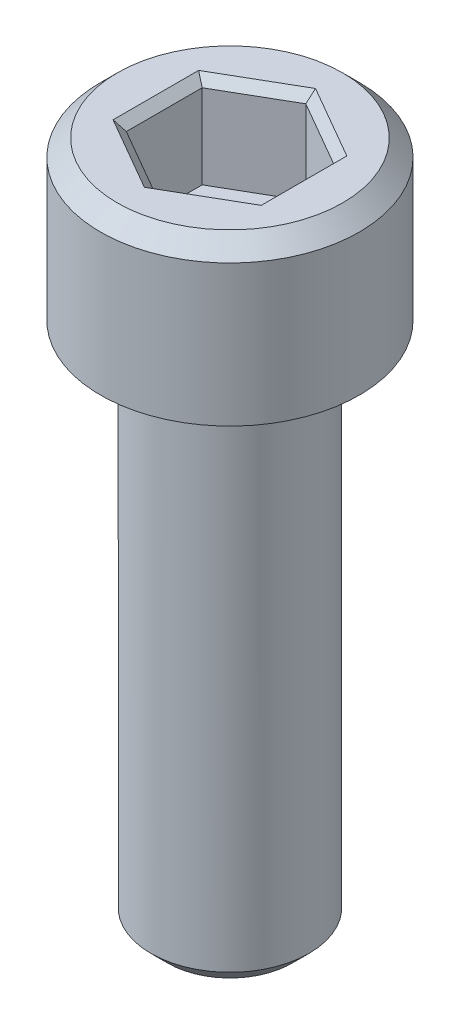
ISO-10303-21;
HEADER;
FILE_DESCRIPTION(('STEP AP214'),'2;1');
FILE_NAME('part.step','',(''),(''),'','','');
FILE_SCHEMA(('AUTOMOTIVE_DESIGN { 1 0 10303 214 1 1 1 1 }'));
ENDSEC;
DATA;
#1=APPLICATION_CONTEXT('core data for automotive mechanical design processes');
#2=APPLICATION_PROTOCOL_DEFINITION('international standard','automotive_design',2000,#1);
#3=PRODUCT_CONTEXT('',#1,'mechanical');
#4=PRODUCT('Part','Part','',(#3));
#5=PRODUCT_RELATED_PRODUCT_CATEGORY('part','',(#4));
#6=PRODUCT_DEFINITION_FORMATION('','',#4);
#7=PRODUCT_DEFINITION_CONTEXT('part definition',#1,'design');
#8=PRODUCT_DEFINITION('design','',#6,#7);
#9=PRODUCT_DEFINITION_SHAPE('','',#8);
#10=(LENGTH_UNIT() NAMED_UNIT(*) SI_UNIT(.MILLI.,.METRE.));
#11=(NAMED_UNIT(*) PLANE_ANGLE_UNIT() SI_UNIT($,.RADIAN.));
#12=(NAMED_UNIT(*) SI_UNIT($,.STERADIAN.) SOLID_ANGLE_UNIT());
#13=UNCERTAINTY_MEASURE_WITH_UNIT(LENGTH_MEASURE(1.E-05),#10,'distance_accuracy_value','');
#14=(GEOMETRIC_REPRESENTATION_CONTEXT(3) GLOBAL_UNCERTAINTY_ASSIGNED_CONTEXT((#13)) GLOBAL_UNIT_ASSIGNED_CONTEXT((#10,
#11,#12)) REPRESENTATION_CONTEXT('',''));
#15=CARTESIAN_POINT('',(0.,0.,0.));
#16=DIRECTION('',(0.,0.,1.));
#17=DIRECTION('',(1.,0.,0.));
#18=AXIS2_PLACEMENT_3D('',#15,#16,#17);
#19=CARTESIAN_POINT('',(-3.96874999999999,-2.794,0.));
#20=DIRECTION('',(0.,-1.,0.));
#21=DIRECTION('',(0.,0.,-1.));
#22=AXIS2_PLACEMENT_3D('',#19,#20,#21);
#23=PLANE('',#22);
#24=DIRECTION('',(-0.866025403784439,0.,0.5));
#25=VECTOR('',#24,1.);
#26=CARTESIAN_POINT('',(1.98437500000001,-2.794,1.14567944042317));
#27=LINE('',#26,#25);
#28=CARTESIAN_POINT('',(1.98437500000001,-2.794,1.14567944042317));
#29=VERTEX_POINT('',#28);
#30=CARTESIAN_POINT('',(0.,-2.794,2.29135888084634));
#31=VERTEX_POINT('',#30);
#32=EDGE_CURVE('E86',#29,#31,#27,.T.);
#33=ORIENTED_EDGE('',*,*,#32,.F.);
#34=DIRECTION('',(0.,0.,1.));
#35=VECTOR('',#34,1.);
#36=CARTESIAN_POINT('',(1.98437500000001,-2.794,-1.14567944042316));
#37=LINE('',#36,#35);
#38=CARTESIAN_POINT('',(1.98437500000001,-2.794,-1.14567944042316));
#39=VERTEX_POINT('',#38);
#40=EDGE_CURVE('E91',#39,#29,#37,.T.);
#41=ORIENTED_EDGE('',*,*,#40,.F.);
#42=DIRECTION('',(0.866025403784439,0.,0.5));
#43=VECTOR('',#42,1.);
#44=CARTESIAN_POINT('',(0.,-2.794,-2.29135888084632));
#45=LINE('',#44,#43);
#46=CARTESIAN_POINT('',(0.,-2.794,-2.29135888084632));
#47=VERTEX_POINT('',#46);
#48=EDGE_CURVE('E176',#47,#39,#45,.T.);
#49=ORIENTED_EDGE('',*,*,#48,.F.);
#50=DIRECTION('',(0.866025403784438,0.,-0.5));
#51=VECTOR('',#50,1.);
#52=CARTESIAN_POINT('',(-1.98437499999999,-2.794,-1.14567944042316));
#53=LINE('',#52,#51);
#54=CARTESIAN_POINT('',(-1.984375,-2.794,-1.14567944042316));
#55=VERTEX_POINT('',#54);
#56=EDGE_CURVE('E182',#55,#47,#53,.T.);
#57=ORIENTED_EDGE('',*,*,#56,.F.);
#58=DIRECTION('',(0.,0.,-1.));
#59=VECTOR('',#58,1.);
#60=CARTESIAN_POINT('',(-1.984375,-2.794,1.14567944042317));
#61=LINE('',#60,#59);
#62=CARTESIAN_POINT('',(-1.984375,-2.794,1.14567944042317));
#63=VERTEX_POINT('',#62);
#64=EDGE_CURVE('E187',#63,#55,#61,.T.);
#65=ORIENTED_EDGE('',*,*,#64,.F.);
#66=DIRECTION('',(-0.866025403784438,0.,-0.5));
#67=VECTOR('',#66,1.);
#68=CARTESIAN_POINT('',(0.,-2.794,2.29135888084634));
#69=LINE('',#68,#67);
#70=EDGE_CURVE('E102',#31,#63,#69,.T.);
#71=ORIENTED_EDGE('',*,*,#70,.F.);
#72=EDGE_LOOP('',(#33,#41,#49,#57,#65,#71));
#73=FACE_BOUND('',#72,.T.);
#74=ADVANCED_FACE('F17',(#73),#23,.F.);
#75=CARTESIAN_POINT('',(1.98437500000001,-2.794,-1.14567944042316));
#76=DIRECTION('',(-1.,0.,0.));
#77=DIRECTION('',(0.,0.,1.));
#78=AXIS2_PLACEMENT_3D('',#75,#76,#77);
#79=PLANE('',#78);
#80=DIRECTION('',(0.,1.,0.));
#81=VECTOR('',#80,1.);
#82=CARTESIAN_POINT('',(1.98437500000001,-2.794,-1.14567944042316));
#83=LINE('',#82,#81);
#84=CARTESIAN_POINT('',(1.98437500000001,-0.254,-1.14567944042316));
#85=VERTEX_POINT('',#84);
#86=EDGE_CURVE('E96',#39,#85,#83,.T.);
#87=ORIENTED_EDGE('',*,*,#86,.F.);
#88=ORIENTED_EDGE('',*,*,#40,.T.);
#89=DIRECTION('',(0.,1.,0.));
#90=VECTOR('',#89,1.);
#91=CARTESIAN_POINT('',(1.98437500000001,-2.794,1.14567944042317));
#92=LINE('',#91,#90);
#93=CARTESIAN_POINT('',(1.98437500000001,-0.254,1.14567944042317));
#94=VERTEX_POINT('',#93);
#95=EDGE_CURVE('E93',#94,#29,#92,.F.);
#96=ORIENTED_EDGE('',*,*,#95,.F.);
#97=DIRECTION('',(0.,0.,1.));
#98=VECTOR('',#97,1.);
#99=CARTESIAN_POINT('',(1.98437500000001,-0.254,0.));
#100=LINE('',#99,#98);
#101=EDGE_CURVE('E174',#94,#85,#100,.F.);
#102=ORIENTED_EDGE('',*,*,#101,.T.);
#103=EDGE_LOOP('',(#87,#88,#96,#102));
#104=FACE_BOUND('',#103,.T.);
#105=ADVANCED_FACE('F92',(#104),#79,.T.);
#106=CARTESIAN_POINT('',(1.98437500000001,-2.794,1.14567944042317));
#107=DIRECTION('',(-0.5,0.,-0.866025403784439));
#108=DIRECTION('',(-0.866025403784439,0.,0.5));
#109=AXIS2_PLACEMENT_3D('',#106,#107,#108);
#110=PLANE('',#109);
#111=ORIENTED_EDGE('',*,*,#95,.T.);
#112=ORIENTED_EDGE('',*,*,#32,.T.);
#113=DIRECTION('',(0.,1.,0.));
#114=VECTOR('',#113,1.);
#115=CARTESIAN_POINT('',(0.,-2.794,2.29135888084634));
#116=LINE('',#115,#114);
#117=CARTESIAN_POINT('',(0.,-0.253999999999999,2.29135888084634));
#118=VERTEX_POINT('',#117);
#119=EDGE_CURVE('E104',#118,#31,#116,.F.);
#120=ORIENTED_EDGE('',*,*,#119,.F.);
#121=DIRECTION('',(0.866025403784439,0.,-0.5));
#122=VECTOR('',#121,1.);
#123=CARTESIAN_POINT('',(0.,-0.253999999999998,2.29135888084634));
#124=LINE('',#123,#122);
#125=EDGE_CURVE('E108',#118,#94,#124,.T.);
#126=ORIENTED_EDGE('',*,*,#125,.T.);
#127=EDGE_LOOP('',(#111,#112,#120,#126));
#128=FACE_BOUND('',#127,.T.);
#129=ADVANCED_FACE('F106',(#128),#110,.T.);
#130=CARTESIAN_POINT('',(0.,-2.794,2.29135888084634));
#131=DIRECTION('',(0.5,0.,-0.866025403784438));
#132=DIRECTION('',(-0.866025403784438,0.,-0.5));
#133=AXIS2_PLACEMENT_3D('',#130,#131,#132);
#134=PLANE('',#133);
#135=ORIENTED_EDGE('',*,*,#119,.T.);
#136=ORIENTED_EDGE('',*,*,#70,.T.);
#137=DIRECTION('',(0.,1.,0.));
#138=VECTOR('',#137,1.);
#139=CARTESIAN_POINT('',(-1.984375,-2.794,1.14567944042317));
#140=LINE('',#139,#138);
#141=CARTESIAN_POINT('',(-1.984375,-0.254,1.14567944042317));
#142=VERTEX_POINT('',#141);
#143=EDGE_CURVE('E189',#142,#63,#140,.F.);
#144=ORIENTED_EDGE('',*,*,#143,.F.);
#145=DIRECTION('',(0.866025403784438,0.,0.500000000000001));
#146=VECTOR('',#145,1.);
#147=CARTESIAN_POINT('',(-1.984375,-0.254,1.14567944042317));
#148=LINE('',#147,#146);
#149=EDGE_CURVE('E168',#142,#118,#148,.T.);
#150=ORIENTED_EDGE('',*,*,#149,.T.);
#151=EDGE_LOOP('',(#135,#136,#144,#150));
#152=FACE_BOUND('',#151,.T.);
#153=ADVANCED_FACE('F193',(#152),#134,.T.);
#154=CARTESIAN_POINT('',(-1.984375,-2.794,1.14567944042317));
#155=DIRECTION('',(1.,0.,0.));
#156=DIRECTION('',(0.,0.,-1.));
#157=AXIS2_PLACEMENT_3D('',#154,#155,#156);
#158=PLANE('',#157);
#159=ORIENTED_EDGE('',*,*,#143,.T.);
#160=ORIENTED_EDGE('',*,*,#64,.T.);
#161=DIRECTION('',(0.,1.,0.));
#162=VECTOR('',#161,1.);
#163=CARTESIAN_POINT('',(-1.984375,-2.794,-1.14567944042316));
#164=LINE('',#163,#162);
#165=CARTESIAN_POINT('',(-1.984375,-0.253999999999999,-1.14567944042316));
#166=VERTEX_POINT('',#165);
#167=EDGE_CURVE('E184',#166,#55,#164,.F.);
#168=ORIENTED_EDGE('',*,*,#167,.F.);
#169=DIRECTION('',(0.,0.,1.));
#170=VECTOR('',#169,1.);
#171=CARTESIAN_POINT('',(-1.984375,-0.254,0.));
#172=LINE('',#171,#170);
#173=EDGE_CURVE('E163',#166,#142,#172,.T.);
#174=ORIENTED_EDGE('',*,*,#173,.T.);
#175=EDGE_LOOP('',(#159,#160,#168,#174));
#176=FACE_BOUND('',#175,.T.);
#177=ADVANCED_FACE('F223',(#176),#158,.T.);
#178=CARTESIAN_POINT('',(-1.98437499999999,-2.794,-1.14567944042316));
#179=DIRECTION('',(0.5,0.,0.866025403784438));
#180=DIRECTION('',(0.866025403784438,0.,-0.5));
#181=AXIS2_PLACEMENT_3D('',#178,#179,#180);
#182=PLANE('',#181);
#183=ORIENTED_EDGE('',*,*,#167,.T.);
#184=ORIENTED_EDGE('',*,*,#56,.T.);
#185=DIRECTION('',(0.,1.,0.));
#186=VECTOR('',#185,1.);
#187=CARTESIAN_POINT('',(0.,-2.794,-2.29135888084632));
#188=LINE('',#187,#186);
#189=CARTESIAN_POINT('',(0.,-0.254,-2.29135888084632));
#190=VERTEX_POINT('',#189);
#191=EDGE_CURVE('E178',#190,#47,#188,.F.);
#192=ORIENTED_EDGE('',*,*,#191,.F.);
#193=DIRECTION('',(-0.866025403784439,0.,0.499999999999999));
#194=VECTOR('',#193,1.);
#195=CARTESIAN_POINT('',(0.,-0.253999999999999,-2.29135888084632));
#196=LINE('',#195,#194);
#197=EDGE_CURVE('E158',#190,#166,#196,.T.);
#198=ORIENTED_EDGE('',*,*,#197,.T.);
#199=EDGE_LOOP('',(#183,#184,#192,#198));
#200=FACE_BOUND('',#199,.T.);
#201=ADVANCED_FACE('F219',(#200),#182,.T.);
#202=CARTESIAN_POINT('',(0.,-2.794,-2.29135888084632));
#203=DIRECTION('',(-0.5,0.,0.866025403784439));
#204=DIRECTION('',(0.866025403784439,0.,0.5));
#205=AXIS2_PLACEMENT_3D('',#202,#203,#204);
#206=PLANE('',#205);
#207=ORIENTED_EDGE('',*,*,#191,.T.);
#208=ORIENTED_EDGE('',*,*,#48,.T.);
#209=ORIENTED_EDGE('',*,*,#86,.T.);
#210=DIRECTION('',(-0.866025403784439,0.,-0.499999999999999));
#211=VECTOR('',#210,1.);
#212=CARTESIAN_POINT('',(1.98437500000001,-0.253999999999997,-1.14567944042316));
#213=LINE('',#212,#211);
#214=EDGE_CURVE('E150',#85,#190,#213,.T.);
#215=ORIENTED_EDGE('',*,*,#214,.T.);
#216=EDGE_LOOP('',(#207,#208,#209,#215));
#217=FACE_BOUND('',#216,.T.);
#218=ADVANCED_FACE('F214',(#217),#206,.T.);
#219=CARTESIAN_POINT('',(2.23837500000001,0.,0.));
#220=DIRECTION('',(0.707106781186548,-0.707106781186548,0.));
#221=DIRECTION('',(0.707106781186548,0.707106781186548,0.));
#222=AXIS2_PLACEMENT_3D('',#219,#220,#221);
#223=PLANE('',#222);
#224=ORIENTED_EDGE('',*,*,#101,.F.);
#225=DIRECTION('',(0.654653670707971,0.654653670707979,0.377964473009234));
#226=VECTOR('',#225,1.);
#227=CARTESIAN_POINT('',(1.98437500000001,-0.254,1.14567944042317));
#228=LINE('',#227,#226);
#229=CARTESIAN_POINT('',(2.23837500000001,0.,1.29232640879734));
#230=VERTEX_POINT('',#229);
#231=EDGE_CURVE('E171',#94,#230,#228,.T.);
#232=ORIENTED_EDGE('',*,*,#231,.T.);
#233=DIRECTION('',(0.,0.,1.));
#234=VECTOR('',#233,1.);
#235=CARTESIAN_POINT('',(2.23837500000001,0.,0.));
#236=LINE('',#235,#234);
#237=CARTESIAN_POINT('',(2.23837500000001,0.,-1.29232640879732));
#238=VERTEX_POINT('',#237);
#239=EDGE_CURVE('E146',#238,#230,#236,.T.);
#240=ORIENTED_EDGE('',*,*,#239,.F.);
#241=DIRECTION('',(-0.654653670707983,-0.654653670707975,0.377964473009222));
#242=VECTOR('',#241,1.);
#243=CARTESIAN_POINT('',(2.23837500000001,0.,-1.29232640879732));
#244=LINE('',#243,#242);
#245=EDGE_CURVE('E153',#238,#85,#244,.T.);
#246=ORIENTED_EDGE('',*,*,#245,.T.);
#247=EDGE_LOOP('',(#224,#232,#240,#246));
#248=FACE_BOUND('',#247,.T.);
#249=ADVANCED_FACE('F209',(#248),#223,.F.);
#250=CARTESIAN_POINT('',(1.11918750000001,0.,1.938489613196));
#251=DIRECTION('',(0.353553390593273,-0.707106781186548,0.612372435695794));
#252=DIRECTION('',(0.,-0.654653670707977,-0.755928946018455));
#253=AXIS2_PLACEMENT_3D('',#250,#251,#252);
#254=PLANE('',#253);
#255=ORIENTED_EDGE('',*,*,#125,.F.);
#256=DIRECTION('',(0.,-0.654653670707977,-0.755928946018455));
#257=VECTOR('',#256,1.);
#258=CARTESIAN_POINT('',(0.,-0.319767857142859,2.21541670079543));
#259=LINE('',#258,#257);
#260=CARTESIAN_POINT('',(0.,0.,2.58465281759467));
#261=VERTEX_POINT('',#260);
#262=EDGE_CURVE('E166',#118,#261,#259,.F.);
#263=ORIENTED_EDGE('',*,*,#262,.T.);
#264=DIRECTION('',(-0.866025403784439,0.,0.5));
#265=VECTOR('',#264,1.);
#266=CARTESIAN_POINT('',(2.23837500000001,0.,1.29232640879734));
#267=LINE('',#266,#265);
#268=EDGE_CURVE('E143',#230,#261,#267,.T.);
#269=ORIENTED_EDGE('',*,*,#268,.F.);
#270=ORIENTED_EDGE('',*,*,#231,.F.);
#271=EDGE_LOOP('',(#255,#263,#269,#270));
#272=FACE_BOUND('',#271,.T.);
#273=ADVANCED_FACE('F200',(#272),#254,.F.);
#274=CARTESIAN_POINT('',(-1.1191875,0.,1.938489613196));
#275=DIRECTION('',(-0.353553390593274,-0.707106781186548,0.612372435695794));
#276=DIRECTION('',(0.,-0.654653670707977,-0.755928946018455));
#277=AXIS2_PLACEMENT_3D('',#274,#275,#276);
#278=PLANE('',#277);
#279=DIRECTION('',(-0.866025403784437,0.,-0.500000000000002));
#280=VECTOR('',#279,1.);
#281=CARTESIAN_POINT('',(0.,0.,2.58465281759467));
#282=LINE('',#281,#280);
#283=CARTESIAN_POINT('',(-2.238375,0.,1.29232640879733));
#284=VERTEX_POINT('',#283);
#285=EDGE_CURVE('E140',#261,#284,#282,.T.);
#286=ORIENTED_EDGE('',*,*,#285,.F.);
#287=ORIENTED_EDGE('',*,*,#262,.F.);
#288=ORIENTED_EDGE('',*,*,#149,.F.);
#289=DIRECTION('',(-0.65465367070798,0.65465367070798,0.377964473009216));
#290=VECTOR('',#289,1.);
#291=CARTESIAN_POINT('',(-1.984375,-0.254,1.14567944042317));
#292=LINE('',#291,#290);
#293=EDGE_CURVE('E161',#142,#284,#292,.T.);
#294=ORIENTED_EDGE('',*,*,#293,.T.);
#295=EDGE_LOOP('',(#286,#287,#288,#294));
#296=FACE_BOUND('',#295,.T.);
#297=ADVANCED_FACE('F203',(#296),#278,.F.);
#298=CARTESIAN_POINT('',(-2.238375,0.,0.));
#299=DIRECTION('',(-0.707106781186548,-0.707106781186548,0.));
#300=DIRECTION('',(0.707106781186548,-0.707106781186548,0.));
#301=AXIS2_PLACEMENT_3D('',#298,#299,#300);
#302=PLANE('',#301);
#303=DIRECTION('',(0.,0.,1.));
#304=VECTOR('',#303,1.);
#305=CARTESIAN_POINT('',(-2.238375,0.,0.));
#306=LINE('',#305,#304);
#307=CARTESIAN_POINT('',(-2.238375,0.,-1.29232640879732));
#308=VERTEX_POINT('',#307);
#309=EDGE_CURVE('E137',#284,#308,#306,.F.);
#310=ORIENTED_EDGE('',*,*,#309,.F.);
#311=ORIENTED_EDGE('',*,*,#293,.F.);
#312=ORIENTED_EDGE('',*,*,#173,.F.);
#313=DIRECTION('',(-0.654653670707983,0.654653670707975,-0.377964473009222));
#314=VECTOR('',#313,1.);
#315=CARTESIAN_POINT('',(-1.984375,-0.253999999999995,-1.14567944042316));
#316=LINE('',#315,#314);
#317=EDGE_CURVE('E156',#166,#308,#316,.T.);
#318=ORIENTED_EDGE('',*,*,#317,.T.);
#319=EDGE_LOOP('',(#310,#311,#312,#318));
#320=FACE_BOUND('',#319,.T.);
#321=ADVANCED_FACE('F221',(#320),#302,.F.);
#322=CARTESIAN_POINT('',(-1.1191875,0.,-1.93848961319598));
#323=DIRECTION('',(-0.353553390593274,-0.707106781186548,-0.612372435695794));
#324=DIRECTION('',(0.,0.654653670707977,-0.755928946018455));
#325=AXIS2_PLACEMENT_3D('',#322,#323,#324);
#326=PLANE('',#325);
#327=ORIENTED_EDGE('',*,*,#197,.F.);
#328=DIRECTION('',(0.,0.654653670707977,-0.755928946018455));
#329=VECTOR('',#328,1.);
#330=CARTESIAN_POINT('',(0.,-0.319767857142856,-2.21541670079542));
#331=LINE('',#330,#329);
#332=CARTESIAN_POINT('',(0.,0.,-2.58465281759465));
#333=VERTEX_POINT('',#332);
#334=EDGE_CURVE('E35',#190,#333,#331,.T.);
#335=ORIENTED_EDGE('',*,*,#334,.T.);
#336=DIRECTION('',(0.866025403784439,0.,-0.499999999999999));
#337=VECTOR('',#336,1.);
#338=CARTESIAN_POINT('',(-2.238375,0.,-1.29232640879732));
#339=LINE('',#338,#337);
#340=EDGE_CURVE('E134',#308,#333,#339,.T.);
#341=ORIENTED_EDGE('',*,*,#340,.F.);
#342=ORIENTED_EDGE('',*,*,#317,.F.);
#343=EDGE_LOOP('',(#327,#335,#341,#342));
#344=FACE_BOUND('',#343,.T.);
#345=ADVANCED_FACE('F216',(#344),#326,.F.);
#346=CARTESIAN_POINT('',(1.1191875,0.,-1.93848961319599));
#347=DIRECTION('',(0.353553390593274,-0.707106781186548,-0.612372435695794));
#348=DIRECTION('',(0.,0.654653670707977,-0.755928946018455));
#349=AXIS2_PLACEMENT_3D('',#346,#347,#348);
#350=PLANE('',#349);
#351=ORIENTED_EDGE('',*,*,#214,.F.);
#352=ORIENTED_EDGE('',*,*,#245,.F.);
#353=DIRECTION('',(0.866025403784439,0.,0.5));
#354=VECTOR('',#353,1.);
#355=CARTESIAN_POINT('',(0.,0.,-2.58465281759465));
#356=LINE('',#355,#354);
#357=EDGE_CURVE('E125',#333,#238,#356,.T.);
#358=ORIENTED_EDGE('',*,*,#357,.F.);
#359=ORIENTED_EDGE('',*,*,#334,.F.);
#360=EDGE_LOOP('',(#351,#352,#358,#359));
#361=FACE_BOUND('',#360,.T.);
#362=ADVANCED_FACE('F212',(#361),#350,.F.);
#363=CARTESIAN_POINT('',(0.,0.,0.));
#364=DIRECTION('',(0.,1.,0.));
#365=DIRECTION('',(0.,0.,1.));
#366=AXIS2_PLACEMENT_3D('',#363,#364,#365);
#367=PLANE('',#366);
#368=CARTESIAN_POINT('',(0.,0.,0.));
#369=DIRECTION('',(0.,-1.,0.));
#370=DIRECTION('',(0.,0.,-1.));
#371=AXIS2_PLACEMENT_3D('',#368,#369,#370);
#372=CIRCLE('',#371,3.40360000006967);
#373=CARTESIAN_POINT('',(0.,0.,-3.40360000006967));
#374=VERTEX_POINT('',#373);
#375=EDGE_CURVE('E20',#374,#374,#372,.T.);
#376=ORIENTED_EDGE('',*,*,#375,.F.);
#377=EDGE_LOOP('',(#376));
#378=FACE_BOUND('',#377,.T.);
#379=ORIENTED_EDGE('',*,*,#340,.T.);
#380=ORIENTED_EDGE('',*,*,#357,.T.);
#381=ORIENTED_EDGE('',*,*,#239,.T.);
#382=ORIENTED_EDGE('',*,*,#268,.T.);
#383=ORIENTED_EDGE('',*,*,#285,.T.);
#384=ORIENTED_EDGE('',*,*,#309,.T.);
#385=EDGE_LOOP('',(#379,#380,#381,#382,#383,#384));
#386=FACE_BOUND('',#385,.T.);
#387=ADVANCED_FACE('F206',(#378,#386),#367,.T.);
#388=CARTESIAN_POINT('',(0.,-0.507999999967979,0.));
#389=DIRECTION('',(0.,-1.,0.));
#390=DIRECTION('',(0.,0.,-1.));
#391=AXIS2_PLACEMENT_3D('',#388,#389,#390);
#392=CONICAL_SURFACE('',#391,3.91160000003765,0.785398163397448);
#393=ORIENTED_EDGE('',*,*,#375,.T.);
#394=EDGE_LOOP('',(#393));
#395=FACE_BOUND('',#394,.T.);
#396=CARTESIAN_POINT('',(0.,-0.508,0.));
#397=DIRECTION('',(0.,-1.,0.));
#398=DIRECTION('',(0.,0.,-1.));
#399=AXIS2_PLACEMENT_3D('',#396,#397,#398);
#400=CIRCLE('',#399,3.9116);
#401=CARTESIAN_POINT('',(0.,-0.508,-3.9116));
#402=VERTEX_POINT('',#401);
#403=EDGE_CURVE('E117',#402,#402,#400,.T.);
#404=ORIENTED_EDGE('',*,*,#403,.F.);
#405=EDGE_LOOP('',(#404));
#406=FACE_BOUND('',#405,.T.);
#407=ADVANCED_FACE('F257',(#395,#406),#392,.T.);
#408=CARTESIAN_POINT('',(0.,-20.6502,0.));
#409=DIRECTION('',(0.,1.,0.));
#410=DIRECTION('',(0.,0.,1.));
#411=AXIS2_PLACEMENT_3D('',#408,#409,#410);
#412=PLANE('',#411);
#413=CARTESIAN_POINT('',(0.,-20.6502000000341,0.));
#414=DIRECTION('',(0.,1.,0.));
#415=DIRECTION('',(0.,0.,1.));
#416=AXIS2_PLACEMENT_3D('',#413,#414,#415);
#417=CIRCLE('',#416,1.87959999999521);
#418=CARTESIAN_POINT('',(0.,-20.6502000000341,1.87959999999521));
#419=VERTEX_POINT('',#418);
#420=EDGE_CURVE('E115',#419,#419,#417,.T.);
#421=ORIENTED_EDGE('',*,*,#420,.F.);
#422=EDGE_LOOP('',(#421));
#423=FACE_BOUND('',#422,.T.);
#424=ADVANCED_FACE('F253',(#423),#412,.F.);
#425=CARTESIAN_POINT('',(0.,-4.7752,0.));
#426=DIRECTION('',(0.,-1.,0.));
#427=DIRECTION('',(0.,0.,-1.));
#428=AXIS2_PLACEMENT_3D('',#425,#426,#427);
#429=CYLINDRICAL_SURFACE('',#428,3.9116);
#430=CARTESIAN_POINT('',(0.,-4.7752,0.));
#431=DIRECTION('',(0.,-1.,0.));
#432=DIRECTION('',(0.,0.,-1.));
#433=AXIS2_PLACEMENT_3D('',#430,#431,#432);
#434=CIRCLE('',#433,3.9116);
#435=CARTESIAN_POINT('',(0.,-4.7752,-3.9116));
#436=VERTEX_POINT('',#435);
#437=EDGE_CURVE('E113',#436,#436,#434,.F.);
#438=ORIENTED_EDGE('',*,*,#437,.T.);
#439=EDGE_LOOP('',(#438));
#440=FACE_BOUND('',#439,.T.);
#441=ORIENTED_EDGE('',*,*,#403,.T.);
#442=EDGE_LOOP('',(#441));
#443=FACE_BOUND('',#442,.T.);
#444=ADVANCED_FACE('F249',(#440,#443),#429,.T.);
#445=CARTESIAN_POINT('',(0.,-20.1422000000662,0.));
#446=DIRECTION('',(0.,1.,0.));
#447=DIRECTION('',(0.,0.,1.));
#448=AXIS2_PLACEMENT_3D('',#445,#446,#447);
#449=CONICAL_SURFACE('',#448,2.38759999996319,0.785398163397448);
#450=CARTESIAN_POINT('',(0.,-20.1422,0.));
#451=DIRECTION('',(0.,-1.,0.));
#452=DIRECTION('',(0.,0.,-1.));
#453=AXIS2_PLACEMENT_3D('',#450,#451,#452);
#454=CIRCLE('',#453,2.3876);
#455=CARTESIAN_POINT('',(0.,-20.1422,-2.3876));
#456=VERTEX_POINT('',#455);
#457=EDGE_CURVE('E26',#456,#456,#454,.F.);
#458=ORIENTED_EDGE('',*,*,#457,.F.);
#459=EDGE_LOOP('',(#458));
#460=FACE_BOUND('',#459,.T.);
#461=ORIENTED_EDGE('',*,*,#420,.T.);
#462=EDGE_LOOP('',(#461));
#463=FACE_BOUND('',#462,.T.);
#464=ADVANCED_FACE('F242',(#460,#463),#449,.T.);
#465=CARTESIAN_POINT('',(0.,-4.7752,0.));
#466=DIRECTION('',(0.,1.,0.));
#467=DIRECTION('',(0.,0.,1.));
#468=AXIS2_PLACEMENT_3D('',#465,#466,#467);
#469=PLANE('',#468);
#470=ORIENTED_EDGE('',*,*,#437,.F.);
#471=EDGE_LOOP('',(#470));
#472=FACE_BOUND('',#471,.T.);
#473=CARTESIAN_POINT('',(0.,-4.7752,0.));
#474=DIRECTION('',(0.,-1.,0.));
#475=DIRECTION('',(0.,0.,-1.));
#476=AXIS2_PLACEMENT_3D('',#473,#474,#475);
#477=CIRCLE('',#476,2.3876);
#478=CARTESIAN_POINT('',(0.,-4.7752,-2.3876));
#479=VERTEX_POINT('',#478);
#480=EDGE_CURVE('E11',#479,#479,#477,.T.);
#481=ORIENTED_EDGE('',*,*,#480,.F.);
#482=EDGE_LOOP('',(#481));
#483=FACE_BOUND('',#482,.T.);
#484=ADVANCED_FACE('F236',(#472,#483),#469,.F.);
#485=CARTESIAN_POINT('',(0.,-20.6502,0.));
#486=DIRECTION('',(0.,-1.,0.));
#487=DIRECTION('',(0.,0.,-1.));
#488=AXIS2_PLACEMENT_3D('',#485,#486,#487);
#489=CYLINDRICAL_SURFACE('',#488,2.3876);
#490=ORIENTED_EDGE('',*,*,#480,.T.);
#491=EDGE_LOOP('',(#490));
#492=FACE_BOUND('',#491,.T.);
#493=ORIENTED_EDGE('',*,*,#457,.T.);
#494=EDGE_LOOP('',(#493));
#495=FACE_BOUND('',#494,.T.);
#496=ADVANCED_FACE('F234',(#492,#495),#489,.T.);
#497=CLOSED_SHELL('',(#74,#105,#129,#153,#177,#201,#218,#249,#273,#297,#321,#345,#362,#387,#407,
#424,#444,#464,#484,#496));
#498=MANIFOLD_SOLID_BREP('B1',#497);
#499=ADVANCED_BREP_SHAPE_REPRESENTATION('',(#18,#498),#14);
#500=SHAPE_DEFINITION_REPRESENTATION(#9,#499);
ENDSEC;
END-ISO-10303-21;
